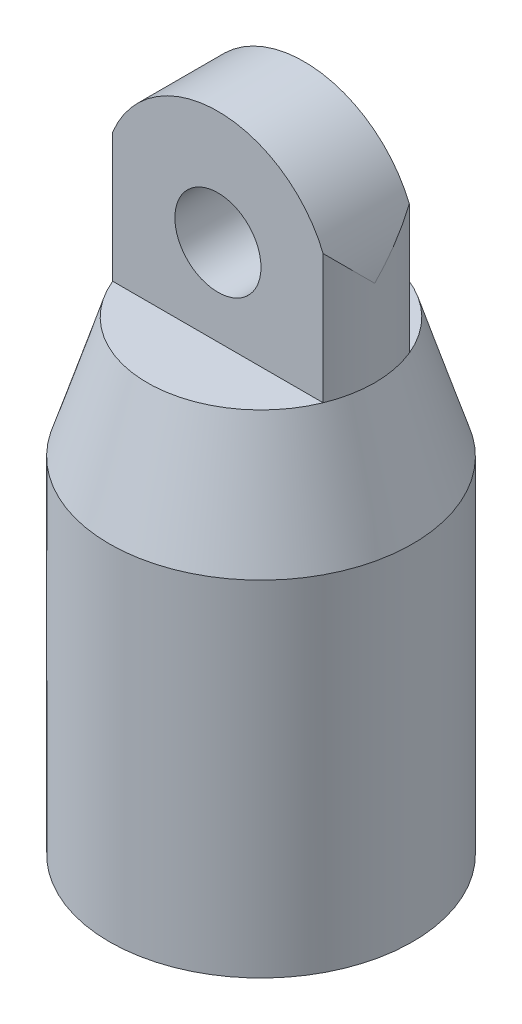
ISO-10303-21;
HEADER;
FILE_DESCRIPTION(('STEP AP214'),'2;1');
FILE_NAME('part.step','',(''),(''),'','','');
FILE_SCHEMA(('AUTOMOTIVE_DESIGN { 1 0 10303 214 1 1 1 1 }'));
ENDSEC;
DATA;
#1=APPLICATION_CONTEXT('core data for automotive mechanical design processes');
#2=APPLICATION_PROTOCOL_DEFINITION('international standard','automotive_design',2000,#1);
#3=PRODUCT_CONTEXT('',#1,'mechanical');
#4=PRODUCT('Part','Part','',(#3));
#5=PRODUCT_RELATED_PRODUCT_CATEGORY('part','',(#4));
#6=PRODUCT_DEFINITION_FORMATION('','',#4);
#7=PRODUCT_DEFINITION_CONTEXT('part definition',#1,'design');
#8=PRODUCT_DEFINITION('design','',#6,#7);
#9=PRODUCT_DEFINITION_SHAPE('','',#8);
#10=(LENGTH_UNIT() NAMED_UNIT(*) SI_UNIT(.MILLI.,.METRE.));
#11=(NAMED_UNIT(*) PLANE_ANGLE_UNIT() SI_UNIT($,.RADIAN.));
#12=(NAMED_UNIT(*) SI_UNIT($,.STERADIAN.) SOLID_ANGLE_UNIT());
#13=UNCERTAINTY_MEASURE_WITH_UNIT(LENGTH_MEASURE(1.E-05),#10,'distance_accuracy_value','');
#14=(GEOMETRIC_REPRESENTATION_CONTEXT(3) GLOBAL_UNCERTAINTY_ASSIGNED_CONTEXT((#13)) GLOBAL_UNIT_ASSIGNED_CONTEXT((#10,
#11,#12)) REPRESENTATION_CONTEXT('',''));
#15=CARTESIAN_POINT('',(0.,0.,0.));
#16=DIRECTION('',(0.,0.,1.));
#17=DIRECTION('',(1.,0.,0.));
#18=AXIS2_PLACEMENT_3D('',#15,#16,#17);
#19=CARTESIAN_POINT('',(0.,20.32,1.5875));
#20=DIRECTION('',(0.,0.,-1.));
#21=DIRECTION('',(-1.,0.,0.));
#22=AXIS2_PLACEMENT_3D('',#19,#20,#21);
#23=PLANE('',#22);
#24=CARTESIAN_POINT('',(0.,20.32,1.5875));
#25=DIRECTION('',(0.,0.,1.));
#26=DIRECTION('',(1.,0.,0.));
#27=AXIS2_PLACEMENT_3D('',#24,#25,#26);
#28=CIRCLE('',#27,1.5875);
#29=CARTESIAN_POINT('',(1.5875,20.32,1.5875));
#30=VERTEX_POINT('',#29);
#31=EDGE_CURVE('E169',#30,#30,#28,.T.);
#32=ORIENTED_EDGE('',*,*,#31,.F.);
#33=EDGE_LOOP('',(#32));
#34=FACE_BOUND('',#33,.T.);
#35=DIRECTION('',(0.,-1.,0.));
#36=VECTOR('',#35,1.);
#37=CARTESIAN_POINT('',(3.87870142573516,42.545,1.5875));
#38=LINE('',#37,#36);
#39=CARTESIAN_POINT('',(3.87870142573516,21.9075,1.5875));
#40=VERTEX_POINT('',#39);
#41=CARTESIAN_POINT('',(3.87870142573516,17.145,1.5875));
#42=VERTEX_POINT('',#41);
#43=EDGE_CURVE('E92',#40,#42,#38,.T.);
#44=ORIENTED_EDGE('',*,*,#43,.F.);
#45=CARTESIAN_POINT('',(0.,20.32,1.5875));
#46=DIRECTION('',(0.,0.,1.));
#47=DIRECTION('',(-1.,0.,0.));
#48=AXIS2_PLACEMENT_3D('',#45,#46,#47);
#49=CIRCLE('',#48,4.191);
#50=CARTESIAN_POINT('',(-3.87870142573516,21.9075,1.5875));
#51=VERTEX_POINT('',#50);
#52=EDGE_CURVE('E124',#40,#51,#49,.T.);
#53=ORIENTED_EDGE('',*,*,#52,.T.);
#54=DIRECTION('',(0.,-1.,0.));
#55=VECTOR('',#54,1.);
#56=CARTESIAN_POINT('',(-3.87870142573516,42.545,1.5875));
#57=LINE('',#56,#55);
#58=CARTESIAN_POINT('',(-3.87870142573516,17.145,1.5875));
#59=VERTEX_POINT('',#58);
#60=EDGE_CURVE('E65',#59,#51,#57,.F.);
#61=ORIENTED_EDGE('',*,*,#60,.F.);
#62=DIRECTION('',(1.,0.,0.));
#63=VECTOR('',#62,1.);
#64=CARTESIAN_POINT('',(-4.191,17.145,1.5875));
#65=LINE('',#64,#63);
#66=EDGE_CURVE('E118',#59,#42,#65,.T.);
#67=ORIENTED_EDGE('',*,*,#66,.T.);
#68=EDGE_LOOP('',(#44,#53,#61,#67));
#69=FACE_BOUND('',#68,.T.);
#70=ADVANCED_FACE('F42',(#34,#69),#23,.F.);
#71=CARTESIAN_POINT('',(0.,20.32,-1.5875));
#72=DIRECTION('',(0.,0.,-1.));
#73=DIRECTION('',(-1.,0.,0.));
#74=AXIS2_PLACEMENT_3D('',#71,#72,#73);
#75=PLANE('',#74);
#76=CARTESIAN_POINT('',(0.,20.32,-1.5875));
#77=DIRECTION('',(0.,0.,1.));
#78=DIRECTION('',(1.,0.,0.));
#79=AXIS2_PLACEMENT_3D('',#76,#77,#78);
#80=CIRCLE('',#79,1.5875);
#81=CARTESIAN_POINT('',(1.5875,20.32,-1.5875));
#82=VERTEX_POINT('',#81);
#83=EDGE_CURVE('E159',#82,#82,#80,.T.);
#84=ORIENTED_EDGE('',*,*,#83,.T.);
#85=EDGE_LOOP('',(#84));
#86=FACE_BOUND('',#85,.T.);
#87=CARTESIAN_POINT('',(0.,20.32,-1.5875));
#88=DIRECTION('',(0.,0.,1.));
#89=DIRECTION('',(-1.,0.,0.));
#90=AXIS2_PLACEMENT_3D('',#87,#88,#89);
#91=CIRCLE('',#90,4.191);
#92=CARTESIAN_POINT('',(3.87870142573516,21.9075,-1.5875));
#93=VERTEX_POINT('',#92);
#94=CARTESIAN_POINT('',(-3.87870142573516,21.9075,-1.5875));
#95=VERTEX_POINT('',#94);
#96=EDGE_CURVE('E110',#93,#95,#91,.T.);
#97=ORIENTED_EDGE('',*,*,#96,.F.);
#98=DIRECTION('',(0.,-1.,0.));
#99=VECTOR('',#98,1.);
#100=CARTESIAN_POINT('',(3.87870142573516,42.545,-1.5875));
#101=LINE('',#100,#99);
#102=CARTESIAN_POINT('',(3.87870142573516,17.145,-1.5875));
#103=VERTEX_POINT('',#102);
#104=EDGE_CURVE('E90',#93,#103,#101,.T.);
#105=ORIENTED_EDGE('',*,*,#104,.T.);
#106=DIRECTION('',(1.,0.,0.));
#107=VECTOR('',#106,1.);
#108=CARTESIAN_POINT('',(-4.191,17.145,-1.5875));
#109=LINE('',#108,#107);
#110=CARTESIAN_POINT('',(-3.87870142573516,17.145,-1.5875));
#111=VERTEX_POINT('',#110);
#112=EDGE_CURVE('E108',#111,#103,#109,.T.);
#113=ORIENTED_EDGE('',*,*,#112,.F.);
#114=DIRECTION('',(0.,-1.,0.));
#115=VECTOR('',#114,1.);
#116=CARTESIAN_POINT('',(-3.87870142573516,42.545,-1.5875));
#117=LINE('',#116,#115);
#118=EDGE_CURVE('E163',#111,#95,#117,.F.);
#119=ORIENTED_EDGE('',*,*,#118,.T.);
#120=EDGE_LOOP('',(#97,#105,#113,#119));
#121=FACE_BOUND('',#120,.T.);
#122=ADVANCED_FACE('F106',(#86,#121),#75,.T.);
#123=CARTESIAN_POINT('',(0.,20.32,1.5875));
#124=DIRECTION('',(0.,0.,-1.));
#125=DIRECTION('',(-1.,0.,0.));
#126=AXIS2_PLACEMENT_3D('',#123,#124,#125);
#127=CYLINDRICAL_SURFACE('',#126,4.191);
#128=CARTESIAN_POINT('',(0.,20.32,0.));
#129=DIRECTION('',(0.,-0.707106781186547,-0.707106781186547));
#130=DIRECTION('',(0.,0.707106781186547,-0.707106781186547));
#131=AXIS2_PLACEMENT_3D('',#128,#129,#130);
#132=ELLIPSE('',#131,5.92696903990564,4.191);
#133=CARTESIAN_POINT('',(4.191,20.32,0.));
#134=VERTEX_POINT('',#133);
#135=EDGE_CURVE('E12',#93,#134,#132,.T.);
#136=ORIENTED_EDGE('',*,*,#135,.F.);
#137=ORIENTED_EDGE('',*,*,#96,.T.);
#138=CARTESIAN_POINT('',(-4.191,20.32,0.));
#139=VERTEX_POINT('',#138);
#140=EDGE_CURVE('E46',#139,#95,#132,.T.);
#141=ORIENTED_EDGE('',*,*,#140,.F.);
#142=CARTESIAN_POINT('',(0.,20.32,0.));
#143=DIRECTION('',(0.,0.707106781186547,-0.707106781186547));
#144=DIRECTION('',(0.,-0.707106781186547,-0.707106781186547));
#145=AXIS2_PLACEMENT_3D('',#142,#143,#144);
#146=ELLIPSE('',#145,5.92696903990564,4.191);
#147=EDGE_CURVE('E117',#51,#139,#146,.F.);
#148=ORIENTED_EDGE('',*,*,#147,.F.);
#149=ORIENTED_EDGE('',*,*,#52,.F.);
#150=EDGE_CURVE('E52',#134,#40,#146,.F.);
#151=ORIENTED_EDGE('',*,*,#150,.F.);
#152=EDGE_LOOP('',(#136,#137,#141,#148,#149,#151));
#153=FACE_BOUND('',#152,.T.);
#154=ADVANCED_FACE('F161',(#153),#127,.T.);
#155=CARTESIAN_POINT('',(-2.159,17.145,0.));
#156=DIRECTION('',(0.,-1.,0.));
#157=DIRECTION('',(0.,0.,-1.));
#158=AXIS2_PLACEMENT_3D('',#155,#156,#157);
#159=PLANE('',#158);
#160=ORIENTED_EDGE('',*,*,#66,.F.);
#161=CARTESIAN_POINT('',(0.,17.145,0.));
#162=DIRECTION('',(0.,-1.,0.));
#163=DIRECTION('',(0.,0.,-1.));
#164=AXIS2_PLACEMENT_3D('',#161,#162,#163);
#165=CIRCLE('',#164,4.191);
#166=EDGE_CURVE('E99',#42,#59,#165,.T.);
#167=ORIENTED_EDGE('',*,*,#166,.F.);
#168=EDGE_LOOP('',(#160,#167));
#169=FACE_BOUND('',#168,.T.);
#170=ADVANCED_FACE('F179',(#169),#159,.F.);
#171=CARTESIAN_POINT('',(0.,0.,0.));
#172=DIRECTION('',(0.,1.,0.));
#173=DIRECTION('',(0.,0.,1.));
#174=AXIS2_PLACEMENT_3D('',#171,#172,#173);
#175=PLANE('',#174);
#176=CARTESIAN_POINT('',(0.,0.,0.));
#177=DIRECTION('',(0.,1.,0.));
#178=DIRECTION('',(0.,0.,1.));
#179=AXIS2_PLACEMENT_3D('',#176,#177,#178);
#180=CIRCLE('',#179,5.588);
#181=CARTESIAN_POINT('',(0.,0.,5.588));
#182=VERTEX_POINT('',#181);
#183=EDGE_CURVE('E142',#182,#182,#180,.T.);
#184=ORIENTED_EDGE('',*,*,#183,.F.);
#185=EDGE_LOOP('',(#184));
#186=FACE_BOUND('',#185,.T.);
#187=CARTESIAN_POINT('',(0.,0.,0.));
#188=DIRECTION('',(0.,1.,0.));
#189=DIRECTION('',(0.,0.,1.));
#190=AXIS2_PLACEMENT_3D('',#187,#188,#189);
#191=CIRCLE('',#190,4.572);
#192=CARTESIAN_POINT('',(0.,0.,4.572));
#193=VERTEX_POINT('',#192);
#194=EDGE_CURVE('E138',#193,#193,#191,.T.);
#195=ORIENTED_EDGE('',*,*,#194,.T.);
#196=EDGE_LOOP('',(#195));
#197=FACE_BOUND('',#196,.T.);
#198=ADVANCED_FACE('F181',(#186,#197),#175,.F.);
#199=CARTESIAN_POINT('',(0.,12.7,0.));
#200=DIRECTION('',(0.,-1.,0.));
#201=DIRECTION('',(0.,0.,-1.));
#202=AXIS2_PLACEMENT_3D('',#199,#200,#201);
#203=CYLINDRICAL_SURFACE('',#202,5.588);
#204=CARTESIAN_POINT('',(0.,12.7,0.));
#205=DIRECTION('',(0.,1.,0.));
#206=DIRECTION('',(0.,0.,1.));
#207=AXIS2_PLACEMENT_3D('',#204,#205,#206);
#208=CIRCLE('',#207,5.588);
#209=CARTESIAN_POINT('',(0.,12.7,5.588));
#210=VERTEX_POINT('',#209);
#211=EDGE_CURVE('E143',#210,#210,#208,.T.);
#212=ORIENTED_EDGE('',*,*,#211,.F.);
#213=EDGE_LOOP('',(#212));
#214=FACE_BOUND('',#213,.T.);
#215=ORIENTED_EDGE('',*,*,#183,.T.);
#216=EDGE_LOOP('',(#215));
#217=FACE_BOUND('',#216,.T.);
#218=ADVANCED_FACE('F44',(#214,#217),#203,.T.);
#219=CARTESIAN_POINT('',(0.,12.7,0.));
#220=DIRECTION('',(0.,-1.,0.));
#221=DIRECTION('',(0.,0.,-1.));
#222=AXIS2_PLACEMENT_3D('',#219,#220,#221);
#223=CYLINDRICAL_SURFACE('',#222,4.572);
#224=CARTESIAN_POINT('',(0.,12.7,0.));
#225=DIRECTION('',(0.,-1.,0.));
#226=DIRECTION('',(0.,0.,-1.));
#227=AXIS2_PLACEMENT_3D('',#224,#225,#226);
#228=CIRCLE('',#227,4.572);
#229=CARTESIAN_POINT('',(0.,12.7,-4.572));
#230=VERTEX_POINT('',#229);
#231=EDGE_CURVE('E134',#230,#230,#228,.T.);
#232=ORIENTED_EDGE('',*,*,#231,.F.);
#233=EDGE_LOOP('',(#232));
#234=FACE_BOUND('',#233,.T.);
#235=ORIENTED_EDGE('',*,*,#194,.F.);
#236=EDGE_LOOP('',(#235));
#237=FACE_BOUND('',#236,.T.);
#238=ADVANCED_FACE('F278',(#234,#237),#223,.F.);
#239=CARTESIAN_POINT('',(-2.159,15.113,0.));
#240=DIRECTION('',(0.,1.,0.));
#241=DIRECTION('',(0.,0.,1.));
#242=AXIS2_PLACEMENT_3D('',#239,#240,#241);
#243=PLANE('',#242);
#244=CARTESIAN_POINT('',(0.,15.113,0.));
#245=DIRECTION('',(0.,-1.,0.));
#246=DIRECTION('',(0.,0.,-1.));
#247=AXIS2_PLACEMENT_3D('',#244,#245,#246);
#248=CIRCLE('',#247,2.159);
#249=CARTESIAN_POINT('',(0.,15.113,-2.159));
#250=VERTEX_POINT('',#249);
#251=EDGE_CURVE('E98',#250,#250,#248,.T.);
#252=ORIENTED_EDGE('',*,*,#251,.T.);
#253=EDGE_LOOP('',(#252));
#254=FACE_BOUND('',#253,.T.);
#255=ADVANCED_FACE('F268',(#254),#243,.F.);
#256=CARTESIAN_POINT('',(0.,12.7,0.));
#257=DIRECTION('',(0.,-1.,0.));
#258=DIRECTION('',(0.,0.,-1.));
#259=AXIS2_PLACEMENT_3D('',#256,#257,#258);
#260=CONICAL_SURFACE('',#259,4.572,0.785398163397446);
#261=ORIENTED_EDGE('',*,*,#251,.F.);
#262=EDGE_LOOP('',(#261));
#263=FACE_BOUND('',#262,.T.);
#264=ORIENTED_EDGE('',*,*,#231,.T.);
#265=EDGE_LOOP('',(#264));
#266=FACE_BOUND('',#265,.T.);
#267=ADVANCED_FACE('F232',(#263,#266),#260,.F.);
#268=CARTESIAN_POINT('',(0.,17.145,0.));
#269=DIRECTION('',(0.,-1.,0.));
#270=DIRECTION('',(0.,0.,-1.));
#271=AXIS2_PLACEMENT_3D('',#268,#269,#270);
#272=CONICAL_SURFACE('',#271,4.191,0.304510883202112);
#273=ORIENTED_EDGE('',*,*,#211,.T.);
#274=EDGE_LOOP('',(#273));
#275=FACE_BOUND('',#274,.T.);
#276=EDGE_CURVE('E87',#103,#42,#165,.T.);
#277=ORIENTED_EDGE('',*,*,#276,.T.);
#278=ORIENTED_EDGE('',*,*,#166,.T.);
#279=EDGE_CURVE('E121',#59,#111,#165,.T.);
#280=ORIENTED_EDGE('',*,*,#279,.T.);
#281=EDGE_CURVE('E101',#111,#103,#165,.T.);
#282=ORIENTED_EDGE('',*,*,#281,.T.);
#283=EDGE_LOOP('',(#277,#278,#280,#282));
#284=FACE_BOUND('',#283,.T.);
#285=ADVANCED_FACE('F120',(#275,#284),#272,.T.);
#286=ORIENTED_EDGE('',*,*,#281,.F.);
#287=ORIENTED_EDGE('',*,*,#112,.T.);
#288=EDGE_LOOP('',(#286,#287));
#289=FACE_BOUND('',#288,.T.);
#290=ADVANCED_FACE('F115',(#289),#159,.F.);
#291=CARTESIAN_POINT('',(0.,20.32,1.5875));
#292=DIRECTION('',(0.,0.,-1.));
#293=DIRECTION('',(-1.,0.,0.));
#294=AXIS2_PLACEMENT_3D('',#291,#292,#293);
#295=CYLINDRICAL_SURFACE('',#294,1.5875);
#296=ORIENTED_EDGE('',*,*,#31,.T.);
#297=EDGE_LOOP('',(#296));
#298=FACE_BOUND('',#297,.T.);
#299=ORIENTED_EDGE('',*,*,#83,.F.);
#300=EDGE_LOOP('',(#299));
#301=FACE_BOUND('',#300,.T.);
#302=ADVANCED_FACE('F191',(#298,#301),#295,.F.);
#303=CARTESIAN_POINT('',(0.,42.545,0.));
#304=DIRECTION('',(0.,-1.,0.));
#305=DIRECTION('',(0.,0.,-1.));
#306=AXIS2_PLACEMENT_3D('',#303,#304,#305);
#307=CYLINDRICAL_SURFACE('',#306,4.191);
#308=ORIENTED_EDGE('',*,*,#147,.T.);
#309=ORIENTED_EDGE('',*,*,#140,.T.);
#310=ORIENTED_EDGE('',*,*,#118,.F.);
#311=ORIENTED_EDGE('',*,*,#279,.F.);
#312=ORIENTED_EDGE('',*,*,#60,.T.);
#313=EDGE_LOOP('',(#308,#309,#310,#311,#312));
#314=FACE_BOUND('',#313,.T.);
#315=ADVANCED_FACE('F162',(#314),#307,.T.);
#316=ORIENTED_EDGE('',*,*,#135,.T.);
#317=ORIENTED_EDGE('',*,*,#150,.T.);
#318=ORIENTED_EDGE('',*,*,#43,.T.);
#319=ORIENTED_EDGE('',*,*,#276,.F.);
#320=ORIENTED_EDGE('',*,*,#104,.F.);
#321=EDGE_LOOP('',(#316,#317,#318,#319,#320));
#322=FACE_BOUND('',#321,.T.);
#323=ADVANCED_FACE('F89',(#322),#307,.T.);
#324=CLOSED_SHELL('',(#70,#122,#154,#170,#198,#218,#238,#255,#267,#285,#290,#302,#315,#323));
#325=MANIFOLD_SOLID_BREP('B2',#324);
#326=ADVANCED_BREP_SHAPE_REPRESENTATION('',(#18,#325),#14);
#327=SHAPE_DEFINITION_REPRESENTATION(#9,#326);
ENDSEC;
END-ISO-10303-21;
